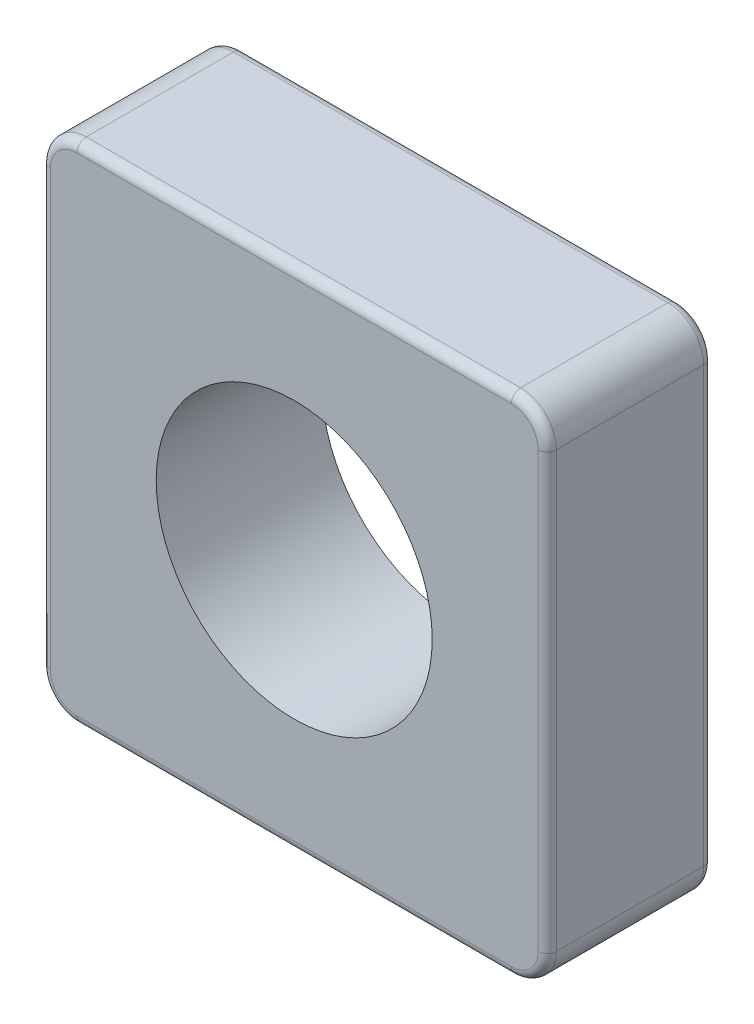
ISO-10303-21;
HEADER;
FILE_DESCRIPTION(('STEP AP214'),'2;1');
FILE_NAME('part.step','',(''),(''),'','','');
FILE_SCHEMA(('AUTOMOTIVE_DESIGN { 1 0 10303 214 1 1 1 1 }'));
ENDSEC;
DATA;
#1=APPLICATION_CONTEXT('core data for automotive mechanical design processes');
#2=APPLICATION_PROTOCOL_DEFINITION('international standard','automotive_design',2000,#1);
#3=PRODUCT_CONTEXT('',#1,'mechanical');
#4=PRODUCT('Part','Part','',(#3));
#5=PRODUCT_RELATED_PRODUCT_CATEGORY('part','',(#4));
#6=PRODUCT_DEFINITION_FORMATION('','',#4);
#7=PRODUCT_DEFINITION_CONTEXT('part definition',#1,'design');
#8=PRODUCT_DEFINITION('design','',#6,#7);
#9=PRODUCT_DEFINITION_SHAPE('','',#8);
#10=(LENGTH_UNIT() NAMED_UNIT(*) SI_UNIT(.MILLI.,.METRE.));
#11=(NAMED_UNIT(*) PLANE_ANGLE_UNIT() SI_UNIT($,.RADIAN.));
#12=(NAMED_UNIT(*) SI_UNIT($,.STERADIAN.) SOLID_ANGLE_UNIT());
#13=UNCERTAINTY_MEASURE_WITH_UNIT(LENGTH_MEASURE(1.E-05),#10,'distance_accuracy_value','');
#14=(GEOMETRIC_REPRESENTATION_CONTEXT(3) GLOBAL_UNCERTAINTY_ASSIGNED_CONTEXT((#13)) GLOBAL_UNIT_ASSIGNED_CONTEXT((#10,
#11,#12)) REPRESENTATION_CONTEXT('',''));
#15=CARTESIAN_POINT('',(0.,0.,0.));
#16=DIRECTION('',(0.,0.,1.));
#17=DIRECTION('',(1.,0.,0.));
#18=AXIS2_PLACEMENT_3D('',#15,#16,#17);
#19=CARTESIAN_POINT('',(0.,0.,1.8));
#20=DIRECTION('',(0.,0.,-1.));
#21=DIRECTION('',(-1.,0.,0.));
#22=AXIS2_PLACEMENT_3D('',#19,#20,#21);
#23=PLANE('',#22);
#24=DIRECTION('',(0.,-1.,0.));
#25=VECTOR('',#24,1.);
#26=CARTESIAN_POINT('',(-2.65,0.,1.8));
#27=LINE('',#26,#25);
#28=CARTESIAN_POINT('',(-2.65,2.36091270347399,1.8));
#29=VERTEX_POINT('',#28);
#30=CARTESIAN_POINT('',(-2.65,-2.36091270347399,1.8));
#31=VERTEX_POINT('',#30);
#32=EDGE_CURVE('E58',#29,#31,#27,.T.);
#33=ORIENTED_EDGE('',*,*,#32,.T.);
#34=CARTESIAN_POINT('',(-2.36091270347399,-2.36091270347399,1.8));
#35=DIRECTION('',(0.,0.,-1.));
#36=DIRECTION('',(-1.,0.,0.));
#37=AXIS2_PLACEMENT_3D('',#34,#35,#36);
#38=CIRCLE('',#37,0.289087296526012);
#39=CARTESIAN_POINT('',(-2.36091270347399,-2.65,1.8));
#40=VERTEX_POINT('',#39);
#41=EDGE_CURVE('E240',#31,#40,#38,.F.);
#42=ORIENTED_EDGE('',*,*,#41,.T.);
#43=DIRECTION('',(1.,0.,0.));
#44=VECTOR('',#43,1.);
#45=CARTESIAN_POINT('',(0.,-2.65,1.8));
#46=LINE('',#45,#44);
#47=CARTESIAN_POINT('',(2.36091270347399,-2.65,1.8));
#48=VERTEX_POINT('',#47);
#49=EDGE_CURVE('E228',#40,#48,#46,.T.);
#50=ORIENTED_EDGE('',*,*,#49,.T.);
#51=CARTESIAN_POINT('',(2.36091270347399,-2.36091270347399,1.8));
#52=DIRECTION('',(0.,0.,-1.));
#53=DIRECTION('',(-1.,0.,0.));
#54=AXIS2_PLACEMENT_3D('',#51,#52,#53);
#55=CIRCLE('',#54,0.289087296526012);
#56=CARTESIAN_POINT('',(2.65,-2.36091270347399,1.8));
#57=VERTEX_POINT('',#56);
#58=EDGE_CURVE('E230',#48,#57,#55,.F.);
#59=ORIENTED_EDGE('',*,*,#58,.T.);
#60=DIRECTION('',(0.,1.,0.));
#61=VECTOR('',#60,1.);
#62=CARTESIAN_POINT('',(2.65,0.,1.8));
#63=LINE('',#62,#61);
#64=CARTESIAN_POINT('',(2.65,2.36091270347399,1.8));
#65=VERTEX_POINT('',#64);
#66=EDGE_CURVE('E232',#57,#65,#63,.T.);
#67=ORIENTED_EDGE('',*,*,#66,.T.);
#68=CARTESIAN_POINT('',(2.36091270347399,2.36091270347399,1.8));
#69=DIRECTION('',(0.,0.,-1.));
#70=DIRECTION('',(-1.,0.,0.));
#71=AXIS2_PLACEMENT_3D('',#68,#69,#70);
#72=CIRCLE('',#71,0.289087296526012);
#73=CARTESIAN_POINT('',(2.36091270347399,2.65,1.8));
#74=VERTEX_POINT('',#73);
#75=EDGE_CURVE('E234',#65,#74,#72,.F.);
#76=ORIENTED_EDGE('',*,*,#75,.T.);
#77=DIRECTION('',(-1.,0.,0.));
#78=VECTOR('',#77,1.);
#79=CARTESIAN_POINT('',(0.,2.65,1.8));
#80=LINE('',#79,#78);
#81=CARTESIAN_POINT('',(-2.36091270347399,2.65,1.8));
#82=VERTEX_POINT('',#81);
#83=EDGE_CURVE('E236',#74,#82,#80,.T.);
#84=ORIENTED_EDGE('',*,*,#83,.T.);
#85=CARTESIAN_POINT('',(-2.36091270347399,2.36091270347399,1.8));
#86=DIRECTION('',(0.,0.,-1.));
#87=DIRECTION('',(-1.,0.,0.));
#88=AXIS2_PLACEMENT_3D('',#85,#86,#87);
#89=CIRCLE('',#88,0.289087296526012);
#90=EDGE_CURVE('E63',#82,#29,#89,.F.);
#91=ORIENTED_EDGE('',*,*,#90,.T.);
#92=EDGE_LOOP('',(#33,#42,#50,#59,#67,#76,#84,#91));
#93=FACE_BOUND('',#92,.T.);
#94=CARTESIAN_POINT('',(0.,0.,1.8));
#95=DIRECTION('',(0.,0.,1.));
#96=DIRECTION('',(1.,0.,0.));
#97=AXIS2_PLACEMENT_3D('',#94,#95,#96);
#98=CIRCLE('',#97,1.5);
#99=CARTESIAN_POINT('',(1.5,0.,1.8));
#100=VERTEX_POINT('',#99);
#101=EDGE_CURVE('E330',#100,#100,#98,.T.);
#102=ORIENTED_EDGE('',*,*,#101,.F.);
#103=EDGE_LOOP('',(#102));
#104=FACE_BOUND('',#103,.T.);
#105=ADVANCED_FACE('F41',(#93,#104),#23,.F.);
#106=CARTESIAN_POINT('',(0.,0.,0.));
#107=DIRECTION('',(0.,0.,-1.));
#108=DIRECTION('',(-1.,0.,0.));
#109=AXIS2_PLACEMENT_3D('',#106,#107,#108);
#110=PLANE('',#109);
#111=DIRECTION('',(1.,0.,0.));
#112=VECTOR('',#111,1.);
#113=CARTESIAN_POINT('',(-2.36091270347399,-2.65,0.));
#114=LINE('',#113,#112);
#115=CARTESIAN_POINT('',(2.36091270347399,-2.65,0.));
#116=VERTEX_POINT('',#115);
#117=CARTESIAN_POINT('',(-2.36091270347399,-2.65,0.));
#118=VERTEX_POINT('',#117);
#119=EDGE_CURVE('E160',#116,#118,#114,.F.);
#120=ORIENTED_EDGE('',*,*,#119,.T.);
#121=CARTESIAN_POINT('',(-2.36091270347399,-2.36091270347399,0.));
#122=DIRECTION('',(0.,0.,-1.));
#123=DIRECTION('',(-1.,0.,0.));
#124=AXIS2_PLACEMENT_3D('',#121,#122,#123);
#125=CIRCLE('',#124,0.289087296526012);
#126=CARTESIAN_POINT('',(-2.65,-2.36091270347399,0.));
#127=VERTEX_POINT('',#126);
#128=EDGE_CURVE('E197',#118,#127,#125,.T.);
#129=ORIENTED_EDGE('',*,*,#128,.T.);
#130=DIRECTION('',(0.,-1.,0.));
#131=VECTOR('',#130,1.);
#132=CARTESIAN_POINT('',(-2.65,2.36091270347399,0.));
#133=LINE('',#132,#131);
#134=CARTESIAN_POINT('',(-2.65,2.36091270347399,0.));
#135=VERTEX_POINT('',#134);
#136=EDGE_CURVE('E195',#127,#135,#133,.F.);
#137=ORIENTED_EDGE('',*,*,#136,.T.);
#138=CARTESIAN_POINT('',(-2.36091270347399,2.36091270347399,0.));
#139=DIRECTION('',(0.,0.,-1.));
#140=DIRECTION('',(-1.,0.,0.));
#141=AXIS2_PLACEMENT_3D('',#138,#139,#140);
#142=CIRCLE('',#141,0.289087296526012);
#143=CARTESIAN_POINT('',(-2.36091270347399,2.65,0.));
#144=VERTEX_POINT('',#143);
#145=EDGE_CURVE('E193',#135,#144,#142,.T.);
#146=ORIENTED_EDGE('',*,*,#145,.T.);
#147=DIRECTION('',(-1.,0.,0.));
#148=VECTOR('',#147,1.);
#149=CARTESIAN_POINT('',(2.36091270347399,2.65,0.));
#150=LINE('',#149,#148);
#151=CARTESIAN_POINT('',(2.36091270347399,2.65,0.));
#152=VERTEX_POINT('',#151);
#153=EDGE_CURVE('E191',#144,#152,#150,.F.);
#154=ORIENTED_EDGE('',*,*,#153,.T.);
#155=CARTESIAN_POINT('',(2.36091270347399,2.36091270347399,0.));
#156=DIRECTION('',(0.,0.,-1.));
#157=DIRECTION('',(-1.,0.,0.));
#158=AXIS2_PLACEMENT_3D('',#155,#156,#157);
#159=CIRCLE('',#158,0.289087296526012);
#160=CARTESIAN_POINT('',(2.65,2.36091270347399,0.));
#161=VERTEX_POINT('',#160);
#162=EDGE_CURVE('E189',#152,#161,#159,.T.);
#163=ORIENTED_EDGE('',*,*,#162,.T.);
#164=DIRECTION('',(0.,1.,0.));
#165=VECTOR('',#164,1.);
#166=CARTESIAN_POINT('',(2.65,-2.36091270347399,0.));
#167=LINE('',#166,#165);
#168=CARTESIAN_POINT('',(2.65,-2.36091270347399,0.));
#169=VERTEX_POINT('',#168);
#170=EDGE_CURVE('E163',#161,#169,#167,.F.);
#171=ORIENTED_EDGE('',*,*,#170,.T.);
#172=CARTESIAN_POINT('',(2.36091270347399,-2.36091270347399,0.));
#173=DIRECTION('',(0.,0.,-1.));
#174=DIRECTION('',(-1.,0.,0.));
#175=AXIS2_PLACEMENT_3D('',#172,#173,#174);
#176=CIRCLE('',#175,0.289087296526012);
#177=EDGE_CURVE('E154',#169,#116,#176,.T.);
#178=ORIENTED_EDGE('',*,*,#177,.T.);
#179=EDGE_LOOP('',(#120,#129,#137,#146,#154,#163,#171,#178));
#180=FACE_BOUND('',#179,.T.);
#181=CARTESIAN_POINT('',(0.,0.,0.));
#182=DIRECTION('',(0.,0.,1.));
#183=DIRECTION('',(1.,0.,0.));
#184=AXIS2_PLACEMENT_3D('',#181,#182,#183);
#185=CIRCLE('',#184,1.5);
#186=CARTESIAN_POINT('',(1.5,0.,0.));
#187=VERTEX_POINT('',#186);
#188=EDGE_CURVE('E258',#187,#187,#185,.T.);
#189=ORIENTED_EDGE('',*,*,#188,.T.);
#190=EDGE_LOOP('',(#189));
#191=FACE_BOUND('',#190,.T.);
#192=ADVANCED_FACE('F156',(#180,#191),#110,.T.);
#193=CARTESIAN_POINT('',(2.75,2.75,1.8));
#194=DIRECTION('',(0.,-1.,0.));
#195=DIRECTION('',(0.,0.,-1.));
#196=AXIS2_PLACEMENT_3D('',#193,#194,#195);
#197=PLANE('',#196);
#198=DIRECTION('',(0.,0.,-1.));
#199=VECTOR('',#198,1.);
#200=CARTESIAN_POINT('',(2.36091270347399,2.75,1.8));
#201=LINE('',#200,#199);
#202=CARTESIAN_POINT('',(2.36091270347399,2.75,1.7));
#203=VERTEX_POINT('',#202);
#204=CARTESIAN_POINT('',(2.36091270347399,2.75,0.1));
#205=VERTEX_POINT('',#204);
#206=EDGE_CURVE('E296',#203,#205,#201,.T.);
#207=ORIENTED_EDGE('',*,*,#206,.T.);
#208=DIRECTION('',(-1.,0.,0.));
#209=VECTOR('',#208,1.);
#210=CARTESIAN_POINT('',(-2.36091270347399,2.75,0.1));
#211=LINE('',#210,#209);
#212=CARTESIAN_POINT('',(-2.36091270347399,2.75,0.1));
#213=VERTEX_POINT('',#212);
#214=EDGE_CURVE('E215',#205,#213,#211,.T.);
#215=ORIENTED_EDGE('',*,*,#214,.T.);
#216=DIRECTION('',(0.,0.,-1.));
#217=VECTOR('',#216,1.);
#218=CARTESIAN_POINT('',(-2.36091270347399,2.75,1.8));
#219=LINE('',#218,#217);
#220=CARTESIAN_POINT('',(-2.36091270347399,2.75,1.7));
#221=VERTEX_POINT('',#220);
#222=EDGE_CURVE('E314',#213,#221,#219,.F.);
#223=ORIENTED_EDGE('',*,*,#222,.T.);
#224=DIRECTION('',(-1.,0.,0.));
#225=VECTOR('',#224,1.);
#226=CARTESIAN_POINT('',(2.75,2.75,1.7));
#227=LINE('',#226,#225);
#228=EDGE_CURVE('E213',#221,#203,#227,.F.);
#229=ORIENTED_EDGE('',*,*,#228,.T.);
#230=EDGE_LOOP('',(#207,#215,#223,#229));
#231=FACE_BOUND('',#230,.T.);
#232=ADVANCED_FACE('F311',(#231),#197,.F.);
#233=CARTESIAN_POINT('',(-2.75,-2.75,1.8));
#234=DIRECTION('',(1.,0.,0.));
#235=DIRECTION('',(0.,0.,-1.));
#236=AXIS2_PLACEMENT_3D('',#233,#234,#235);
#237=PLANE('',#236);
#238=DIRECTION('',(0.,0.,-1.));
#239=VECTOR('',#238,1.);
#240=CARTESIAN_POINT('',(-2.75,2.36091270347399,1.8));
#241=LINE('',#240,#239);
#242=CARTESIAN_POINT('',(-2.75,2.36091270347399,1.7));
#243=VERTEX_POINT('',#242);
#244=CARTESIAN_POINT('',(-2.75,2.36091270347399,0.1));
#245=VERTEX_POINT('',#244);
#246=EDGE_CURVE('E319',#243,#245,#241,.T.);
#247=ORIENTED_EDGE('',*,*,#246,.T.);
#248=DIRECTION('',(0.,-1.,0.));
#249=VECTOR('',#248,1.);
#250=CARTESIAN_POINT('',(-2.75,-2.36091270347399,0.1));
#251=LINE('',#250,#249);
#252=CARTESIAN_POINT('',(-2.75,-2.36091270347399,0.1));
#253=VERTEX_POINT('',#252);
#254=EDGE_CURVE('E207',#245,#253,#251,.T.);
#255=ORIENTED_EDGE('',*,*,#254,.T.);
#256=DIRECTION('',(0.,0.,-1.));
#257=VECTOR('',#256,1.);
#258=CARTESIAN_POINT('',(-2.75,-2.36091270347399,1.8));
#259=LINE('',#258,#257);
#260=CARTESIAN_POINT('',(-2.75,-2.36091270347399,1.7));
#261=VERTEX_POINT('',#260);
#262=EDGE_CURVE('E315',#253,#261,#259,.F.);
#263=ORIENTED_EDGE('',*,*,#262,.T.);
#264=DIRECTION('',(0.,-1.,0.));
#265=VECTOR('',#264,1.);
#266=CARTESIAN_POINT('',(-2.75,-2.75,1.7));
#267=LINE('',#266,#265);
#268=EDGE_CURVE('E205',#261,#243,#267,.F.);
#269=ORIENTED_EDGE('',*,*,#268,.T.);
#270=EDGE_LOOP('',(#247,#255,#263,#269));
#271=FACE_BOUND('',#270,.T.);
#272=ADVANCED_FACE('F353',(#271),#237,.F.);
#273=CARTESIAN_POINT('',(2.75,-2.75,1.8));
#274=DIRECTION('',(0.,1.,0.));
#275=DIRECTION('',(0.,0.,1.));
#276=AXIS2_PLACEMENT_3D('',#273,#274,#275);
#277=PLANE('',#276);
#278=DIRECTION('',(0.,0.,-1.));
#279=VECTOR('',#278,1.);
#280=CARTESIAN_POINT('',(-2.36091270347399,-2.75,1.8));
#281=LINE('',#280,#279);
#282=CARTESIAN_POINT('',(-2.36091270347399,-2.75,1.7));
#283=VERTEX_POINT('',#282);
#284=CARTESIAN_POINT('',(-2.36091270347399,-2.75,0.1));
#285=VERTEX_POINT('',#284);
#286=EDGE_CURVE('E324',#283,#285,#281,.T.);
#287=ORIENTED_EDGE('',*,*,#286,.T.);
#288=DIRECTION('',(1.,0.,0.));
#289=VECTOR('',#288,1.);
#290=CARTESIAN_POINT('',(2.36091270347399,-2.75,0.1));
#291=LINE('',#290,#289);
#292=CARTESIAN_POINT('',(2.36091270347399,-2.75,0.1));
#293=VERTEX_POINT('',#292);
#294=EDGE_CURVE('E11',#285,#293,#291,.T.);
#295=ORIENTED_EDGE('',*,*,#294,.T.);
#296=DIRECTION('',(0.,0.,-1.));
#297=VECTOR('',#296,1.);
#298=CARTESIAN_POINT('',(2.36091270347399,-2.75,1.8));
#299=LINE('',#298,#297);
#300=CARTESIAN_POINT('',(2.36091270347399,-2.75,1.7));
#301=VERTEX_POINT('',#300);
#302=EDGE_CURVE('E327',#293,#301,#299,.F.);
#303=ORIENTED_EDGE('',*,*,#302,.T.);
#304=DIRECTION('',(1.,0.,0.));
#305=VECTOR('',#304,1.);
#306=CARTESIAN_POINT('',(2.75,-2.75,1.7));
#307=LINE('',#306,#305);
#308=EDGE_CURVE('E50',#301,#283,#307,.F.);
#309=ORIENTED_EDGE('',*,*,#308,.T.);
#310=EDGE_LOOP('',(#287,#295,#303,#309));
#311=FACE_BOUND('',#310,.T.);
#312=ADVANCED_FACE('F350',(#311),#277,.F.);
#313=CARTESIAN_POINT('',(2.75,-2.75,1.8));
#314=DIRECTION('',(-1.,0.,0.));
#315=DIRECTION('',(0.,0.,1.));
#316=AXIS2_PLACEMENT_3D('',#313,#314,#315);
#317=PLANE('',#316);
#318=DIRECTION('',(0.,0.,-1.));
#319=VECTOR('',#318,1.);
#320=CARTESIAN_POINT('',(2.75,-2.36091270347399,1.8));
#321=LINE('',#320,#319);
#322=CARTESIAN_POINT('',(2.75,-2.36091270347399,1.7));
#323=VERTEX_POINT('',#322);
#324=CARTESIAN_POINT('',(2.75,-2.36091270347399,0.1));
#325=VERTEX_POINT('',#324);
#326=EDGE_CURVE('E184',#323,#325,#321,.T.);
#327=ORIENTED_EDGE('',*,*,#326,.T.);
#328=DIRECTION('',(0.,1.,0.));
#329=VECTOR('',#328,1.);
#330=CARTESIAN_POINT('',(2.75,2.36091270347399,0.1));
#331=LINE('',#330,#329);
#332=CARTESIAN_POINT('',(2.75,2.36091270347399,0.1));
#333=VERTEX_POINT('',#332);
#334=EDGE_CURVE('E223',#325,#333,#331,.T.);
#335=ORIENTED_EDGE('',*,*,#334,.T.);
#336=DIRECTION('',(0.,0.,-1.));
#337=VECTOR('',#336,1.);
#338=CARTESIAN_POINT('',(2.75,2.36091270347399,1.8));
#339=LINE('',#338,#337);
#340=CARTESIAN_POINT('',(2.75,2.36091270347399,1.7));
#341=VERTEX_POINT('',#340);
#342=EDGE_CURVE('E181',#333,#341,#339,.F.);
#343=ORIENTED_EDGE('',*,*,#342,.T.);
#344=DIRECTION('',(0.,1.,0.));
#345=VECTOR('',#344,1.);
#346=CARTESIAN_POINT('',(2.75,-2.75,1.7));
#347=LINE('',#346,#345);
#348=EDGE_CURVE('E221',#341,#323,#347,.F.);
#349=ORIENTED_EDGE('',*,*,#348,.T.);
#350=EDGE_LOOP('',(#327,#335,#343,#349));
#351=FACE_BOUND('',#350,.T.);
#352=ADVANCED_FACE('F299',(#351),#317,.F.);
#353=CARTESIAN_POINT('',(0.,0.,1.8));
#354=DIRECTION('',(0.,0.,-1.));
#355=DIRECTION('',(-1.,0.,0.));
#356=AXIS2_PLACEMENT_3D('',#353,#354,#355);
#357=CYLINDRICAL_SURFACE('',#356,1.5);
#358=ORIENTED_EDGE('',*,*,#101,.T.);
#359=EDGE_LOOP('',(#358));
#360=FACE_BOUND('',#359,.T.);
#361=ORIENTED_EDGE('',*,*,#188,.F.);
#362=EDGE_LOOP('',(#361));
#363=FACE_BOUND('',#362,.T.);
#364=ADVANCED_FACE('F336',(#360,#363),#357,.F.);
#365=CARTESIAN_POINT('',(-2.36091270347399,-2.36091270347399,1.8));
#366=DIRECTION('',(0.,0.,-1.));
#367=DIRECTION('',(-1.,0.,0.));
#368=AXIS2_PLACEMENT_3D('',#365,#366,#367);
#369=CYLINDRICAL_SURFACE('',#368,0.389087296526012);
#370=ORIENTED_EDGE('',*,*,#262,.F.);
#371=CARTESIAN_POINT('',(-2.36091270347399,-2.36091270347399,0.1));
#372=DIRECTION('',(0.,0.,-1.));
#373=DIRECTION('',(-1.,0.,0.));
#374=AXIS2_PLACEMENT_3D('',#371,#372,#373);
#375=CIRCLE('',#374,0.389087296526012);
#376=EDGE_CURVE('E202',#253,#285,#375,.F.);
#377=ORIENTED_EDGE('',*,*,#376,.T.);
#378=ORIENTED_EDGE('',*,*,#286,.F.);
#379=CARTESIAN_POINT('',(-2.36091270347399,-2.36091270347399,1.7));
#380=DIRECTION('',(0.,0.,-1.));
#381=DIRECTION('',(-1.,0.,0.));
#382=AXIS2_PLACEMENT_3D('',#379,#380,#381);
#383=CIRCLE('',#382,0.389087296526012);
#384=EDGE_CURVE('E199',#283,#261,#383,.T.);
#385=ORIENTED_EDGE('',*,*,#384,.T.);
#386=EDGE_LOOP('',(#370,#377,#378,#385));
#387=FACE_BOUND('',#386,.T.);
#388=ADVANCED_FACE('F360',(#387),#369,.T.);
#389=CARTESIAN_POINT('',(-2.36091270347399,2.36091270347399,1.8));
#390=DIRECTION('',(0.,0.,-1.));
#391=DIRECTION('',(-1.,0.,0.));
#392=AXIS2_PLACEMENT_3D('',#389,#390,#391);
#393=CYLINDRICAL_SURFACE('',#392,0.389087296526012);
#394=ORIENTED_EDGE('',*,*,#222,.F.);
#395=CARTESIAN_POINT('',(-2.36091270347399,2.36091270347399,0.1));
#396=DIRECTION('',(0.,0.,-1.));
#397=DIRECTION('',(-1.,0.,0.));
#398=AXIS2_PLACEMENT_3D('',#395,#396,#397);
#399=CIRCLE('',#398,0.389087296526012);
#400=EDGE_CURVE('E211',#213,#245,#399,.F.);
#401=ORIENTED_EDGE('',*,*,#400,.T.);
#402=ORIENTED_EDGE('',*,*,#246,.F.);
#403=CARTESIAN_POINT('',(-2.36091270347399,2.36091270347399,1.7));
#404=DIRECTION('',(0.,0.,-1.));
#405=DIRECTION('',(-1.,0.,0.));
#406=AXIS2_PLACEMENT_3D('',#403,#404,#405);
#407=CIRCLE('',#406,0.389087296526012);
#408=EDGE_CURVE('E209',#243,#221,#407,.T.);
#409=ORIENTED_EDGE('',*,*,#408,.T.);
#410=EDGE_LOOP('',(#394,#401,#402,#409));
#411=FACE_BOUND('',#410,.T.);
#412=ADVANCED_FACE('F363',(#411),#393,.T.);
#413=CARTESIAN_POINT('',(2.36091270347399,2.36091270347399,1.8));
#414=DIRECTION('',(0.,0.,-1.));
#415=DIRECTION('',(-1.,0.,0.));
#416=AXIS2_PLACEMENT_3D('',#413,#414,#415);
#417=CYLINDRICAL_SURFACE('',#416,0.389087296526012);
#418=ORIENTED_EDGE('',*,*,#342,.F.);
#419=CARTESIAN_POINT('',(2.36091270347399,2.36091270347399,0.1));
#420=DIRECTION('',(0.,0.,-1.));
#421=DIRECTION('',(-1.,0.,0.));
#422=AXIS2_PLACEMENT_3D('',#419,#420,#421);
#423=CIRCLE('',#422,0.389087296526012);
#424=EDGE_CURVE('E219',#333,#205,#423,.F.);
#425=ORIENTED_EDGE('',*,*,#424,.T.);
#426=ORIENTED_EDGE('',*,*,#206,.F.);
#427=CARTESIAN_POINT('',(2.36091270347399,2.36091270347399,1.7));
#428=DIRECTION('',(0.,0.,-1.));
#429=DIRECTION('',(-1.,0.,0.));
#430=AXIS2_PLACEMENT_3D('',#427,#428,#429);
#431=CIRCLE('',#430,0.389087296526012);
#432=EDGE_CURVE('E217',#203,#341,#431,.T.);
#433=ORIENTED_EDGE('',*,*,#432,.T.);
#434=EDGE_LOOP('',(#418,#425,#426,#433));
#435=FACE_BOUND('',#434,.T.);
#436=ADVANCED_FACE('F293',(#435),#417,.T.);
#437=CARTESIAN_POINT('',(2.36091270347399,-2.36091270347399,1.8));
#438=DIRECTION('',(0.,0.,-1.));
#439=DIRECTION('',(-1.,0.,0.));
#440=AXIS2_PLACEMENT_3D('',#437,#438,#439);
#441=CYLINDRICAL_SURFACE('',#440,0.389087296526012);
#442=ORIENTED_EDGE('',*,*,#302,.F.);
#443=CARTESIAN_POINT('',(2.36091270347399,-2.36091270347399,0.1));
#444=DIRECTION('',(0.,0.,-1.));
#445=DIRECTION('',(-1.,0.,0.));
#446=AXIS2_PLACEMENT_3D('',#443,#444,#445);
#447=CIRCLE('',#446,0.389087296526012);
#448=EDGE_CURVE('E172',#293,#325,#447,.F.);
#449=ORIENTED_EDGE('',*,*,#448,.T.);
#450=ORIENTED_EDGE('',*,*,#326,.F.);
#451=CARTESIAN_POINT('',(2.36091270347399,-2.36091270347399,1.7));
#452=DIRECTION('',(0.,0.,-1.));
#453=DIRECTION('',(-1.,0.,0.));
#454=AXIS2_PLACEMENT_3D('',#451,#452,#453);
#455=CIRCLE('',#454,0.389087296526012);
#456=EDGE_CURVE('E225',#323,#301,#455,.T.);
#457=ORIENTED_EDGE('',*,*,#456,.T.);
#458=EDGE_LOOP('',(#442,#449,#450,#457));
#459=FACE_BOUND('',#458,.T.);
#460=ADVANCED_FACE('F370',(#459),#441,.T.);
#461=CARTESIAN_POINT('',(2.36091270347399,2.36091270347399,0.1));
#462=DIRECTION('',(0.,0.,-1.));
#463=DIRECTION('',(-1.,0.,0.));
#464=AXIS2_PLACEMENT_3D('',#461,#462,#463);
#465=TOROIDAL_SURFACE('',#464,0.289087296526012,0.1);
#466=CARTESIAN_POINT('',(2.36091270347399,2.65,0.1));
#467=DIRECTION('',(-1.,0.,0.));
#468=DIRECTION('',(0.,0.,1.));
#469=AXIS2_PLACEMENT_3D('',#466,#467,#468);
#470=CIRCLE('',#469,0.1);
#471=EDGE_CURVE('E252',#205,#152,#470,.T.);
#472=ORIENTED_EDGE('',*,*,#471,.F.);
#473=ORIENTED_EDGE('',*,*,#424,.F.);
#474=CARTESIAN_POINT('',(2.65,2.36091270347399,0.1));
#475=DIRECTION('',(0.,-1.,0.));
#476=DIRECTION('',(0.,0.,-1.));
#477=AXIS2_PLACEMENT_3D('',#474,#475,#476);
#478=CIRCLE('',#477,0.1);
#479=EDGE_CURVE('E255',#161,#333,#478,.T.);
#480=ORIENTED_EDGE('',*,*,#479,.F.);
#481=ORIENTED_EDGE('',*,*,#162,.F.);
#482=EDGE_LOOP('',(#472,#473,#480,#481));
#483=FACE_BOUND('',#482,.T.);
#484=ADVANCED_FACE('F308',(#483),#465,.T.);
#485=CARTESIAN_POINT('',(2.65,-2.75,0.1));
#486=DIRECTION('',(0.,-1.,0.));
#487=DIRECTION('',(0.,0.,-1.));
#488=AXIS2_PLACEMENT_3D('',#485,#486,#487);
#489=CYLINDRICAL_SURFACE('',#488,0.1);
#490=ORIENTED_EDGE('',*,*,#479,.T.);
#491=ORIENTED_EDGE('',*,*,#334,.F.);
#492=CARTESIAN_POINT('',(2.65,-2.36091270347399,0.1));
#493=DIRECTION('',(0.,-1.,0.));
#494=DIRECTION('',(0.,0.,-1.));
#495=AXIS2_PLACEMENT_3D('',#492,#493,#494);
#496=CIRCLE('',#495,0.1);
#497=EDGE_CURVE('E250',#169,#325,#496,.T.);
#498=ORIENTED_EDGE('',*,*,#497,.F.);
#499=ORIENTED_EDGE('',*,*,#170,.F.);
#500=EDGE_LOOP('',(#490,#491,#498,#499));
#501=FACE_BOUND('',#500,.T.);
#502=ADVANCED_FACE('F303',(#501),#489,.T.);
#503=CARTESIAN_POINT('',(2.75,2.65,0.1));
#504=DIRECTION('',(1.,0.,0.));
#505=DIRECTION('',(0.,0.,-1.));
#506=AXIS2_PLACEMENT_3D('',#503,#504,#505);
#507=CYLINDRICAL_SURFACE('',#506,0.1);
#508=ORIENTED_EDGE('',*,*,#471,.T.);
#509=ORIENTED_EDGE('',*,*,#153,.F.);
#510=CARTESIAN_POINT('',(-2.36091270347399,2.65,0.1));
#511=DIRECTION('',(-1.,0.,0.));
#512=DIRECTION('',(0.,0.,1.));
#513=AXIS2_PLACEMENT_3D('',#510,#511,#512);
#514=CIRCLE('',#513,0.1);
#515=EDGE_CURVE('E175',#213,#144,#514,.T.);
#516=ORIENTED_EDGE('',*,*,#515,.F.);
#517=ORIENTED_EDGE('',*,*,#214,.F.);
#518=EDGE_LOOP('',(#508,#509,#516,#517));
#519=FACE_BOUND('',#518,.T.);
#520=ADVANCED_FACE('F390',(#519),#507,.T.);
#521=CARTESIAN_POINT('',(2.36091270347399,-2.36091270347399,0.1));
#522=DIRECTION('',(0.,0.,-1.));
#523=DIRECTION('',(-1.,0.,0.));
#524=AXIS2_PLACEMENT_3D('',#521,#522,#523);
#525=TOROIDAL_SURFACE('',#524,0.289087296526012,0.1);
#526=ORIENTED_EDGE('',*,*,#497,.T.);
#527=ORIENTED_EDGE('',*,*,#448,.F.);
#528=CARTESIAN_POINT('',(2.36091270347399,-2.65,0.1));
#529=DIRECTION('',(-1.,0.,0.));
#530=DIRECTION('',(0.,0.,1.));
#531=AXIS2_PLACEMENT_3D('',#528,#529,#530);
#532=CIRCLE('',#531,0.1);
#533=EDGE_CURVE('E170',#116,#293,#532,.T.);
#534=ORIENTED_EDGE('',*,*,#533,.F.);
#535=ORIENTED_EDGE('',*,*,#177,.F.);
#536=EDGE_LOOP('',(#526,#527,#534,#535));
#537=FACE_BOUND('',#536,.T.);
#538=ADVANCED_FACE('F171',(#537),#525,.T.);
#539=CARTESIAN_POINT('',(-2.36091270347399,2.36091270347399,0.1));
#540=DIRECTION('',(0.,0.,-1.));
#541=DIRECTION('',(-1.,0.,0.));
#542=AXIS2_PLACEMENT_3D('',#539,#540,#541);
#543=TOROIDAL_SURFACE('',#542,0.289087296526012,0.1);
#544=ORIENTED_EDGE('',*,*,#515,.T.);
#545=ORIENTED_EDGE('',*,*,#145,.F.);
#546=CARTESIAN_POINT('',(-2.65,2.36091270347399,0.1));
#547=DIRECTION('',(0.,-1.,0.));
#548=DIRECTION('',(0.,0.,-1.));
#549=AXIS2_PLACEMENT_3D('',#546,#547,#548);
#550=CIRCLE('',#549,0.1);
#551=EDGE_CURVE('E176',#245,#135,#550,.T.);
#552=ORIENTED_EDGE('',*,*,#551,.F.);
#553=ORIENTED_EDGE('',*,*,#400,.F.);
#554=EDGE_LOOP('',(#544,#545,#552,#553));
#555=FACE_BOUND('',#554,.T.);
#556=ADVANCED_FACE('F384',(#555),#543,.T.);
#557=CARTESIAN_POINT('',(2.75,-2.65,0.1));
#558=DIRECTION('',(-1.,0.,0.));
#559=DIRECTION('',(0.,0.,1.));
#560=AXIS2_PLACEMENT_3D('',#557,#558,#559);
#561=CYLINDRICAL_SURFACE('',#560,0.1);
#562=ORIENTED_EDGE('',*,*,#533,.T.);
#563=ORIENTED_EDGE('',*,*,#294,.F.);
#564=CARTESIAN_POINT('',(-2.36091270347399,-2.65,0.1));
#565=DIRECTION('',(-1.,0.,0.));
#566=DIRECTION('',(0.,0.,1.));
#567=AXIS2_PLACEMENT_3D('',#564,#565,#566);
#568=CIRCLE('',#567,0.1);
#569=EDGE_CURVE('E179',#118,#285,#568,.T.);
#570=ORIENTED_EDGE('',*,*,#569,.F.);
#571=ORIENTED_EDGE('',*,*,#119,.F.);
#572=EDGE_LOOP('',(#562,#563,#570,#571));
#573=FACE_BOUND('',#572,.T.);
#574=ADVANCED_FACE('F178',(#573),#561,.T.);
#575=CARTESIAN_POINT('',(-2.65,-2.75,0.1));
#576=DIRECTION('',(0.,1.,0.));
#577=DIRECTION('',(0.,0.,1.));
#578=AXIS2_PLACEMENT_3D('',#575,#576,#577);
#579=CYLINDRICAL_SURFACE('',#578,0.1);
#580=ORIENTED_EDGE('',*,*,#551,.T.);
#581=ORIENTED_EDGE('',*,*,#136,.F.);
#582=CARTESIAN_POINT('',(-2.65,-2.36091270347399,0.1));
#583=DIRECTION('',(0.,-1.,0.));
#584=DIRECTION('',(0.,0.,-1.));
#585=AXIS2_PLACEMENT_3D('',#582,#583,#584);
#586=CIRCLE('',#585,0.1);
#587=EDGE_CURVE('E243',#253,#127,#586,.T.);
#588=ORIENTED_EDGE('',*,*,#587,.F.);
#589=ORIENTED_EDGE('',*,*,#254,.F.);
#590=EDGE_LOOP('',(#580,#581,#588,#589));
#591=FACE_BOUND('',#590,.T.);
#592=ADVANCED_FACE('F377',(#591),#579,.T.);
#593=CARTESIAN_POINT('',(-2.36091270347399,-2.36091270347399,0.1));
#594=DIRECTION('',(0.,0.,-1.));
#595=DIRECTION('',(-1.,0.,0.));
#596=AXIS2_PLACEMENT_3D('',#593,#594,#595);
#597=TOROIDAL_SURFACE('',#596,0.289087296526012,0.1);
#598=ORIENTED_EDGE('',*,*,#569,.T.);
#599=ORIENTED_EDGE('',*,*,#376,.F.);
#600=ORIENTED_EDGE('',*,*,#587,.T.);
#601=ORIENTED_EDGE('',*,*,#128,.F.);
#602=EDGE_LOOP('',(#598,#599,#600,#601));
#603=FACE_BOUND('',#602,.T.);
#604=ADVANCED_FACE('F374',(#603),#597,.T.);
#605=CARTESIAN_POINT('',(2.36091270347399,2.36091270347399,1.7));
#606=DIRECTION('',(0.,0.,-1.));
#607=DIRECTION('',(-1.,0.,0.));
#608=AXIS2_PLACEMENT_3D('',#605,#606,#607);
#609=TOROIDAL_SURFACE('',#608,0.289087296526012,0.1);
#610=CARTESIAN_POINT('',(2.65,2.36091270347399,1.7));
#611=DIRECTION('',(0.,-1.,0.));
#612=DIRECTION('',(0.,0.,-1.));
#613=AXIS2_PLACEMENT_3D('',#610,#611,#612);
#614=CIRCLE('',#613,0.1);
#615=EDGE_CURVE('E274',#341,#65,#614,.T.);
#616=ORIENTED_EDGE('',*,*,#615,.F.);
#617=ORIENTED_EDGE('',*,*,#432,.F.);
#618=CARTESIAN_POINT('',(2.36091270347399,2.65,1.7));
#619=DIRECTION('',(-1.,0.,0.));
#620=DIRECTION('',(0.,0.,1.));
#621=AXIS2_PLACEMENT_3D('',#618,#619,#620);
#622=CIRCLE('',#621,0.1);
#623=EDGE_CURVE('E45',#74,#203,#622,.T.);
#624=ORIENTED_EDGE('',*,*,#623,.F.);
#625=ORIENTED_EDGE('',*,*,#75,.F.);
#626=EDGE_LOOP('',(#616,#617,#624,#625));
#627=FACE_BOUND('',#626,.T.);
#628=ADVANCED_FACE('F43',(#627),#609,.T.);
#629=CARTESIAN_POINT('',(0.,2.65,1.7));
#630=DIRECTION('',(-1.,0.,0.));
#631=DIRECTION('',(0.,0.,1.));
#632=AXIS2_PLACEMENT_3D('',#629,#630,#631);
#633=CYLINDRICAL_SURFACE('',#632,0.1);
#634=ORIENTED_EDGE('',*,*,#623,.T.);
#635=ORIENTED_EDGE('',*,*,#228,.F.);
#636=CARTESIAN_POINT('',(-2.36091270347399,2.65,1.7));
#637=DIRECTION('',(-1.,0.,0.));
#638=DIRECTION('',(0.,0.,1.));
#639=AXIS2_PLACEMENT_3D('',#636,#637,#638);
#640=CIRCLE('',#639,0.1);
#641=EDGE_CURVE('E272',#82,#221,#640,.T.);
#642=ORIENTED_EDGE('',*,*,#641,.F.);
#643=ORIENTED_EDGE('',*,*,#83,.F.);
#644=EDGE_LOOP('',(#634,#635,#642,#643));
#645=FACE_BOUND('',#644,.T.);
#646=ADVANCED_FACE('F285',(#645),#633,.T.);
#647=CARTESIAN_POINT('',(2.65,0.,1.7));
#648=DIRECTION('',(0.,1.,0.));
#649=DIRECTION('',(0.,0.,1.));
#650=AXIS2_PLACEMENT_3D('',#647,#648,#649);
#651=CYLINDRICAL_SURFACE('',#650,0.1);
#652=ORIENTED_EDGE('',*,*,#615,.T.);
#653=ORIENTED_EDGE('',*,*,#66,.F.);
#654=CARTESIAN_POINT('',(2.65,-2.36091270347399,1.7));
#655=DIRECTION('',(0.,-1.,0.));
#656=DIRECTION('',(0.,0.,-1.));
#657=AXIS2_PLACEMENT_3D('',#654,#655,#656);
#658=CIRCLE('',#657,0.1);
#659=EDGE_CURVE('E269',#323,#57,#658,.T.);
#660=ORIENTED_EDGE('',*,*,#659,.F.);
#661=ORIENTED_EDGE('',*,*,#348,.F.);
#662=EDGE_LOOP('',(#652,#653,#660,#661));
#663=FACE_BOUND('',#662,.T.);
#664=ADVANCED_FACE('F417',(#663),#651,.T.);
#665=CARTESIAN_POINT('',(-2.36091270347399,2.36091270347399,1.7));
#666=DIRECTION('',(0.,0.,-1.));
#667=DIRECTION('',(-1.,0.,0.));
#668=AXIS2_PLACEMENT_3D('',#665,#666,#667);
#669=TOROIDAL_SURFACE('',#668,0.289087296526012,0.1);
#670=ORIENTED_EDGE('',*,*,#641,.T.);
#671=ORIENTED_EDGE('',*,*,#408,.F.);
#672=CARTESIAN_POINT('',(-2.65,2.36091270347399,1.7));
#673=DIRECTION('',(0.,-1.,0.));
#674=DIRECTION('',(0.,0.,-1.));
#675=AXIS2_PLACEMENT_3D('',#672,#673,#674);
#676=CIRCLE('',#675,0.1);
#677=EDGE_CURVE('E266',#29,#243,#676,.T.);
#678=ORIENTED_EDGE('',*,*,#677,.F.);
#679=ORIENTED_EDGE('',*,*,#90,.F.);
#680=EDGE_LOOP('',(#670,#671,#678,#679));
#681=FACE_BOUND('',#680,.T.);
#682=ADVANCED_FACE('F413',(#681),#669,.T.);
#683=CARTESIAN_POINT('',(2.36091270347399,-2.36091270347399,1.7));
#684=DIRECTION('',(0.,0.,-1.));
#685=DIRECTION('',(-1.,0.,0.));
#686=AXIS2_PLACEMENT_3D('',#683,#684,#685);
#687=TOROIDAL_SURFACE('',#686,0.289087296526012,0.1);
#688=ORIENTED_EDGE('',*,*,#659,.T.);
#689=ORIENTED_EDGE('',*,*,#58,.F.);
#690=CARTESIAN_POINT('',(2.36091270347399,-2.65,1.7));
#691=DIRECTION('',(-1.,0.,0.));
#692=DIRECTION('',(0.,0.,1.));
#693=AXIS2_PLACEMENT_3D('',#690,#691,#692);
#694=CIRCLE('',#693,0.1);
#695=EDGE_CURVE('E263',#301,#48,#694,.T.);
#696=ORIENTED_EDGE('',*,*,#695,.F.);
#697=ORIENTED_EDGE('',*,*,#456,.F.);
#698=EDGE_LOOP('',(#688,#689,#696,#697));
#699=FACE_BOUND('',#698,.T.);
#700=ADVANCED_FACE('F409',(#699),#687,.T.);
#701=CARTESIAN_POINT('',(-2.65,0.,1.7));
#702=DIRECTION('',(0.,-1.,0.));
#703=DIRECTION('',(0.,0.,-1.));
#704=AXIS2_PLACEMENT_3D('',#701,#702,#703);
#705=CYLINDRICAL_SURFACE('',#704,0.1);
#706=ORIENTED_EDGE('',*,*,#677,.T.);
#707=ORIENTED_EDGE('',*,*,#268,.F.);
#708=CARTESIAN_POINT('',(-2.65,-2.36091270347399,1.7));
#709=DIRECTION('',(0.,-1.,0.));
#710=DIRECTION('',(0.,0.,-1.));
#711=AXIS2_PLACEMENT_3D('',#708,#709,#710);
#712=CIRCLE('',#711,0.1);
#713=EDGE_CURVE('E261',#31,#261,#712,.T.);
#714=ORIENTED_EDGE('',*,*,#713,.F.);
#715=ORIENTED_EDGE('',*,*,#32,.F.);
#716=EDGE_LOOP('',(#706,#707,#714,#715));
#717=FACE_BOUND('',#716,.T.);
#718=ADVANCED_FACE('F405',(#717),#705,.T.);
#719=CARTESIAN_POINT('',(0.,-2.65,1.7));
#720=DIRECTION('',(1.,0.,0.));
#721=DIRECTION('',(0.,0.,-1.));
#722=AXIS2_PLACEMENT_3D('',#719,#720,#721);
#723=CYLINDRICAL_SURFACE('',#722,0.1);
#724=ORIENTED_EDGE('',*,*,#695,.T.);
#725=ORIENTED_EDGE('',*,*,#49,.F.);
#726=CARTESIAN_POINT('',(-2.36091270347399,-2.65,1.7));
#727=DIRECTION('',(-1.,0.,0.));
#728=DIRECTION('',(0.,0.,1.));
#729=AXIS2_PLACEMENT_3D('',#726,#727,#728);
#730=CIRCLE('',#729,0.1);
#731=EDGE_CURVE('E259',#283,#40,#730,.T.);
#732=ORIENTED_EDGE('',*,*,#731,.F.);
#733=ORIENTED_EDGE('',*,*,#308,.F.);
#734=EDGE_LOOP('',(#724,#725,#732,#733));
#735=FACE_BOUND('',#734,.T.);
#736=ADVANCED_FACE('F401',(#735),#723,.T.);
#737=CARTESIAN_POINT('',(-2.36091270347399,-2.36091270347399,1.7));
#738=DIRECTION('',(0.,0.,-1.));
#739=DIRECTION('',(-1.,0.,0.));
#740=AXIS2_PLACEMENT_3D('',#737,#738,#739);
#741=TOROIDAL_SURFACE('',#740,0.289087296526012,0.1);
#742=ORIENTED_EDGE('',*,*,#713,.T.);
#743=ORIENTED_EDGE('',*,*,#384,.F.);
#744=ORIENTED_EDGE('',*,*,#731,.T.);
#745=ORIENTED_EDGE('',*,*,#41,.F.);
#746=EDGE_LOOP('',(#742,#743,#744,#745));
#747=FACE_BOUND('',#746,.T.);
#748=ADVANCED_FACE('F398',(#747),#741,.T.);
#749=CLOSED_SHELL('',(#105,#192,#232,#272,#312,#352,#364,#388,#412,#436,#460,#484,#502,#520,
#538,#556,#574,#592,#604,#628,#646,#664,#682,#700,#718,#736,#748));
#750=MANIFOLD_SOLID_BREP('B2',#749);
#751=ADVANCED_BREP_SHAPE_REPRESENTATION('',(#18,#750),#14);
#752=SHAPE_DEFINITION_REPRESENTATION(#9,#751);
ENDSEC;
END-ISO-10303-21;
